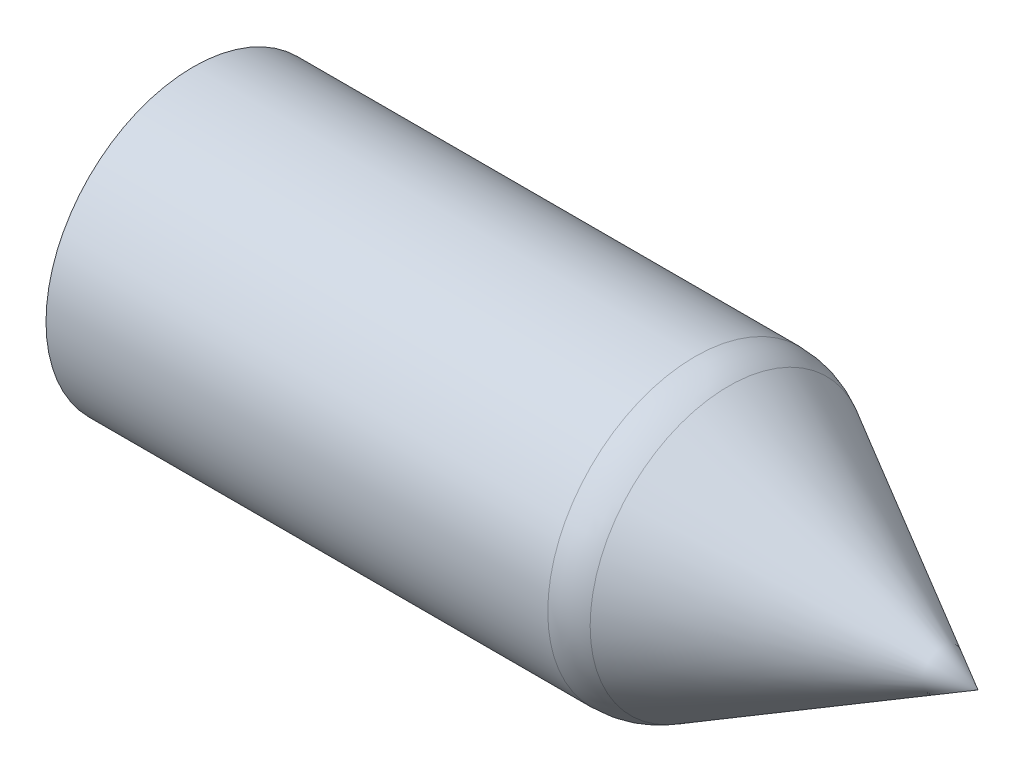
ISO-10303-21;
HEADER;
FILE_DESCRIPTION(('STEP AP214'),'2;1');
FILE_NAME('part.step','',(''),(''),'','','');
FILE_SCHEMA(('AUTOMOTIVE_DESIGN { 1 0 10303 214 1 1 1 1 }'));
ENDSEC;
DATA;
#1=APPLICATION_CONTEXT('core data for automotive mechanical design processes');
#2=APPLICATION_PROTOCOL_DEFINITION('international standard','automotive_design',2000,#1);
#3=PRODUCT_CONTEXT('',#1,'mechanical');
#4=PRODUCT('Part','Part','',(#3));
#5=PRODUCT_RELATED_PRODUCT_CATEGORY('part','',(#4));
#6=PRODUCT_DEFINITION_FORMATION('','',#4);
#7=PRODUCT_DEFINITION_CONTEXT('part definition',#1,'design');
#8=PRODUCT_DEFINITION('design','',#6,#7);
#9=PRODUCT_DEFINITION_SHAPE('','',#8);
#10=(LENGTH_UNIT() NAMED_UNIT(*) SI_UNIT(.MILLI.,.METRE.));
#11=(NAMED_UNIT(*) PLANE_ANGLE_UNIT() SI_UNIT($,.RADIAN.));
#12=(NAMED_UNIT(*) SI_UNIT($,.STERADIAN.) SOLID_ANGLE_UNIT());
#13=UNCERTAINTY_MEASURE_WITH_UNIT(LENGTH_MEASURE(1.E-05),#10,'distance_accuracy_value','');
#14=(GEOMETRIC_REPRESENTATION_CONTEXT(3) GLOBAL_UNCERTAINTY_ASSIGNED_CONTEXT((#13)) GLOBAL_UNIT_ASSIGNED_CONTEXT((#10,
#11,#12)) REPRESENTATION_CONTEXT('',''));
#15=CARTESIAN_POINT('',(0.,0.,0.));
#16=DIRECTION('',(0.,0.,1.));
#17=DIRECTION('',(1.,0.,0.));
#18=AXIS2_PLACEMENT_3D('',#15,#16,#17);
#19=CARTESIAN_POINT('',(0.,0.,0.));
#20=DIRECTION('',(-1.,0.,0.));
#21=DIRECTION('',(0.,0.,1.));
#22=AXIS2_PLACEMENT_3D('',#19,#20,#21);
#23=CONICAL_SURFACE('',#22,0.,0.507180132899761);
#24=CARTESIAN_POINT('',(-7.19543986583629,0.,0.));
#25=DIRECTION('',(1.,0.,0.));
#26=DIRECTION('',(0.,0.,-1.));
#27=AXIS2_PLACEMENT_3D('',#24,#25,#26);
#28=CIRCLE('',#27,3.99823526180324);
#29=CARTESIAN_POINT('',(-7.19543986583629,0.,-3.99823526180324));
#30=VERTEX_POINT('',#29);
#31=EDGE_CURVE('E38',#30,#30,#28,.T.);
#32=ORIENTED_EDGE('',*,*,#31,.T.);
#33=EDGE_LOOP('',(#32));
#34=FACE_BOUND('',#33,.T.);
#35=CARTESIAN_POINT('',(0.,0.,0.));
#36=VERTEX_POINT('',#35);
#37=VERTEX_LOOP('',#36);
#38=FACE_BOUND('',#37,.T.);
#39=ADVANCED_FACE('F31',(#34,#38),#23,.T.);
#40=CARTESIAN_POINT('',(0.,0.,0.));
#41=DIRECTION('',(1.,0.,0.));
#42=DIRECTION('',(0.,0.,-1.));
#43=AXIS2_PLACEMENT_3D('',#40,#41,#42);
#44=CYLINDRICAL_SURFACE('',#43,4.25);
#45=CARTESIAN_POINT('',(-8.16686843726486,0.,0.));
#46=DIRECTION('',(-1.,0.,0.));
#47=DIRECTION('',(0.,0.,1.));
#48=AXIS2_PLACEMENT_3D('',#45,#46,#47);
#49=CIRCLE('',#48,4.25);
#50=CARTESIAN_POINT('',(-8.16686843726486,0.,4.25));
#51=VERTEX_POINT('',#50);
#52=EDGE_CURVE('E11',#51,#51,#49,.T.);
#53=ORIENTED_EDGE('',*,*,#52,.T.);
#54=EDGE_LOOP('',(#53));
#55=FACE_BOUND('',#54,.T.);
#56=CARTESIAN_POINT('',(-22.6485292703892,0.,0.));
#57=DIRECTION('',(1.,0.,0.));
#58=DIRECTION('',(0.,0.,-1.));
#59=AXIS2_PLACEMENT_3D('',#56,#57,#58);
#60=CIRCLE('',#59,4.25);
#61=CARTESIAN_POINT('',(-22.6485292703892,0.,-4.25));
#62=VERTEX_POINT('',#61);
#63=EDGE_CURVE('E60',#62,#62,#60,.T.);
#64=ORIENTED_EDGE('',*,*,#63,.T.);
#65=EDGE_LOOP('',(#64));
#66=FACE_BOUND('',#65,.T.);
#67=ADVANCED_FACE('F42',(#55,#66),#44,.T.);
#68=CARTESIAN_POINT('',(-22.6485292703892,0.,-4.25));
#69=DIRECTION('',(-1.,0.,0.));
#70=DIRECTION('',(0.,0.,1.));
#71=AXIS2_PLACEMENT_3D('',#68,#69,#70);
#72=PLANE('',#71);
#73=ORIENTED_EDGE('',*,*,#63,.F.);
#74=EDGE_LOOP('',(#73));
#75=FACE_BOUND('',#74,.T.);
#76=ADVANCED_FACE('F47',(#75),#72,.T.);
#77=CARTESIAN_POINT('',(-8.16686843726486,0.,0.));
#78=DIRECTION('',(-1.,0.,0.));
#79=DIRECTION('',(0.,0.,1.));
#80=AXIS2_PLACEMENT_3D('',#77,#78,#79);
#81=TOROIDAL_SURFACE('',#80,2.25,2.);
#82=ORIENTED_EDGE('',*,*,#52,.F.);
#83=EDGE_LOOP('',(#82));
#84=FACE_BOUND('',#83,.T.);
#85=ORIENTED_EDGE('',*,*,#31,.F.);
#86=EDGE_LOOP('',(#85));
#87=FACE_BOUND('',#86,.T.);
#88=ADVANCED_FACE('F33',(#84,#87),#81,.T.);
#89=CLOSED_SHELL('',(#39,#67,#76,#88));
#90=MANIFOLD_SOLID_BREP('B2',#89);
#91=ADVANCED_BREP_SHAPE_REPRESENTATION('',(#18,#90),#14);
#92=SHAPE_DEFINITION_REPRESENTATION(#9,#91);
ENDSEC;
END-ISO-10303-21;
